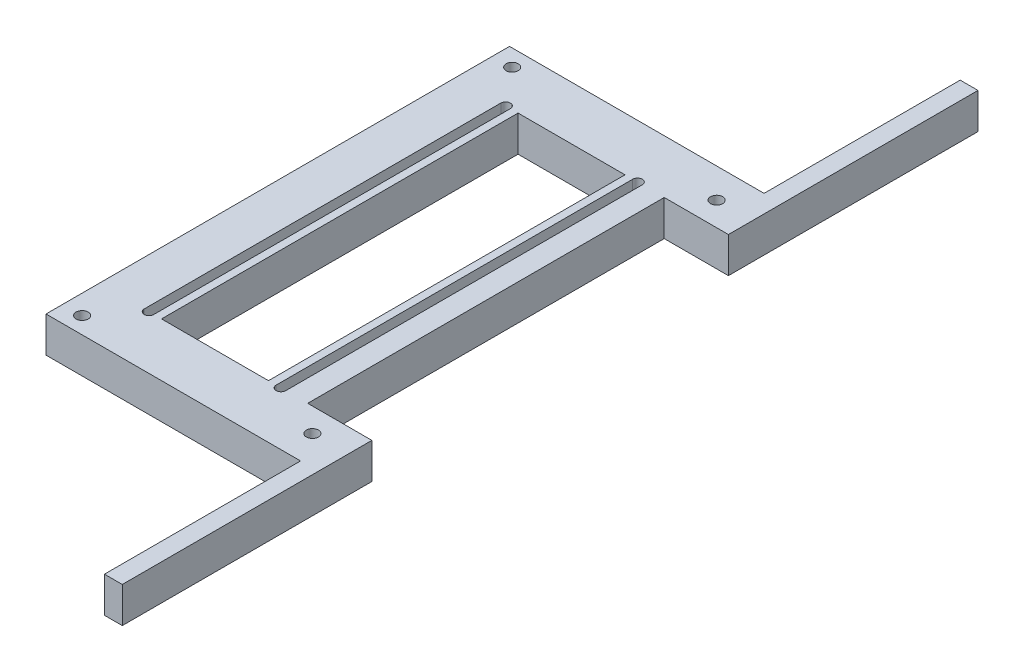
ISO-10303-21;
HEADER;
FILE_DESCRIPTION(('STEP AP214'),'2;1');
FILE_NAME('part.step','',(''),(''),'','','');
FILE_SCHEMA(('AUTOMOTIVE_DESIGN { 1 0 10303 214 1 1 1 1 }'));
ENDSEC;
DATA;
#1=APPLICATION_CONTEXT('core data for automotive mechanical design processes');
#2=APPLICATION_PROTOCOL_DEFINITION('international standard','automotive_design',2000,#1);
#3=PRODUCT_CONTEXT('',#1,'mechanical');
#4=PRODUCT('Part','Part','',(#3));
#5=PRODUCT_RELATED_PRODUCT_CATEGORY('part','',(#4));
#6=PRODUCT_DEFINITION_FORMATION('','',#4);
#7=PRODUCT_DEFINITION_CONTEXT('part definition',#1,'design');
#8=PRODUCT_DEFINITION('design','',#6,#7);
#9=PRODUCT_DEFINITION_SHAPE('','',#8);
#10=(LENGTH_UNIT() NAMED_UNIT(*) SI_UNIT(.MILLI.,.METRE.));
#11=(NAMED_UNIT(*) PLANE_ANGLE_UNIT() SI_UNIT($,.RADIAN.));
#12=(NAMED_UNIT(*) SI_UNIT($,.STERADIAN.) SOLID_ANGLE_UNIT());
#13=UNCERTAINTY_MEASURE_WITH_UNIT(LENGTH_MEASURE(1.E-05),#10,'distance_accuracy_value','');
#14=(GEOMETRIC_REPRESENTATION_CONTEXT(3) GLOBAL_UNCERTAINTY_ASSIGNED_CONTEXT((#13)) GLOBAL_UNIT_ASSIGNED_CONTEXT((#10,
#11,#12)) REPRESENTATION_CONTEXT('',''));
#15=CARTESIAN_POINT('',(0.,0.,0.));
#16=DIRECTION('',(0.,0.,1.));
#17=DIRECTION('',(1.,0.,0.));
#18=AXIS2_PLACEMENT_3D('',#15,#16,#17);
#19=CARTESIAN_POINT('',(5.3842412770572,10.,0.));
#20=DIRECTION('',(-1.,0.,0.));
#21=DIRECTION('',(0.,0.,1.));
#22=AXIS2_PLACEMENT_3D('',#19,#20,#21);
#23=PLANE('',#22);
#24=DIRECTION('',(0.,0.,-1.));
#25=VECTOR('',#24,1.);
#26=CARTESIAN_POINT('',(5.3842412770572,0.,0.));
#27=LINE('',#26,#25);
#28=CARTESIAN_POINT('',(5.38424127705721,0.,31.71875));
#29=VERTEX_POINT('',#28);
#30=CARTESIAN_POINT('',(5.38424127705717,0.,-68.28125));
#31=VERTEX_POINT('',#30);
#32=EDGE_CURVE('E303',#29,#31,#27,.T.);
#33=ORIENTED_EDGE('',*,*,#32,.T.);
#34=DIRECTION('',(0.,-1.,0.));
#35=VECTOR('',#34,1.);
#36=CARTESIAN_POINT('',(5.38424127705717,10.,-68.28125));
#37=LINE('',#36,#35);
#38=CARTESIAN_POINT('',(5.38424127705717,10.,-68.28125));
#39=VERTEX_POINT('',#38);
#40=EDGE_CURVE('E11',#39,#31,#37,.T.);
#41=ORIENTED_EDGE('',*,*,#40,.F.);
#42=DIRECTION('',(0.,0.,-1.));
#43=VECTOR('',#42,1.);
#44=CARTESIAN_POINT('',(5.3842412770572,10.,0.));
#45=LINE('',#44,#43);
#46=CARTESIAN_POINT('',(5.38424127705721,10.,31.71875));
#47=VERTEX_POINT('',#46);
#48=EDGE_CURVE('E214',#47,#39,#45,.T.);
#49=ORIENTED_EDGE('',*,*,#48,.F.);
#50=DIRECTION('',(0.,-1.,0.));
#51=VECTOR('',#50,1.);
#52=CARTESIAN_POINT('',(5.38424127705721,10.,31.71875));
#53=LINE('',#52,#51);
#54=EDGE_CURVE('E58',#47,#29,#53,.T.);
#55=ORIENTED_EDGE('',*,*,#54,.T.);
#56=EDGE_LOOP('',(#33,#41,#49,#55));
#57=FACE_BOUND('',#56,.T.);
#58=ADVANCED_FACE('F39',(#57),#23,.F.);
#59=CARTESIAN_POINT('',(6.73424127705717,10.,-68.28125));
#60=DIRECTION('',(0.,-1.,0.));
#61=DIRECTION('',(0.,0.,-1.));
#62=AXIS2_PLACEMENT_3D('',#59,#60,#61);
#63=CYLINDRICAL_SURFACE('',#62,1.35);
#64=CARTESIAN_POINT('',(6.73424127705717,0.,-68.28125));
#65=DIRECTION('',(0.,1.,0.));
#66=DIRECTION('',(0.,0.,1.));
#67=AXIS2_PLACEMENT_3D('',#64,#65,#66);
#68=CIRCLE('',#67,1.35);
#69=CARTESIAN_POINT('',(8.08424127705717,0.,-68.28125));
#70=VERTEX_POINT('',#69);
#71=EDGE_CURVE('E220',#31,#70,#68,.F.);
#72=ORIENTED_EDGE('',*,*,#71,.T.);
#73=DIRECTION('',(0.,-1.,0.));
#74=VECTOR('',#73,1.);
#75=CARTESIAN_POINT('',(8.08424127705717,10.,-68.28125));
#76=LINE('',#75,#74);
#77=CARTESIAN_POINT('',(8.08424127705717,10.,-68.28125));
#78=VERTEX_POINT('',#77);
#79=EDGE_CURVE('E49',#78,#70,#76,.T.);
#80=ORIENTED_EDGE('',*,*,#79,.F.);
#81=CARTESIAN_POINT('',(6.73424127705717,10.,-68.28125));
#82=DIRECTION('',(0.,1.,0.));
#83=DIRECTION('',(0.,0.,1.));
#84=AXIS2_PLACEMENT_3D('',#81,#82,#83);
#85=CIRCLE('',#84,1.35);
#86=EDGE_CURVE('E208',#39,#78,#85,.F.);
#87=ORIENTED_EDGE('',*,*,#86,.F.);
#88=ORIENTED_EDGE('',*,*,#40,.T.);
#89=EDGE_LOOP('',(#72,#80,#87,#88));
#90=FACE_BOUND('',#89,.T.);
#91=ADVANCED_FACE('F219',(#90),#63,.F.);
#92=CARTESIAN_POINT('',(8.08424127705721,10.,0.));
#93=DIRECTION('',(-1.,0.,0.));
#94=DIRECTION('',(0.,0.,1.));
#95=AXIS2_PLACEMENT_3D('',#92,#93,#94);
#96=PLANE('',#95);
#97=DIRECTION('',(0.,0.,-1.));
#98=VECTOR('',#97,1.);
#99=CARTESIAN_POINT('',(8.08424127705721,0.,0.));
#100=LINE('',#99,#98);
#101=CARTESIAN_POINT('',(8.08424127705721,0.,31.71875));
#102=VERTEX_POINT('',#101);
#103=EDGE_CURVE('E306',#102,#70,#100,.T.);
#104=ORIENTED_EDGE('',*,*,#103,.F.);
#105=DIRECTION('',(0.,-1.,0.));
#106=VECTOR('',#105,1.);
#107=CARTESIAN_POINT('',(8.08424127705721,10.,31.71875));
#108=LINE('',#107,#106);
#109=CARTESIAN_POINT('',(8.08424127705721,10.,31.71875));
#110=VERTEX_POINT('',#109);
#111=EDGE_CURVE('E132',#110,#102,#108,.T.);
#112=ORIENTED_EDGE('',*,*,#111,.F.);
#113=DIRECTION('',(0.,0.,-1.));
#114=VECTOR('',#113,1.);
#115=CARTESIAN_POINT('',(8.08424127705721,10.,0.));
#116=LINE('',#115,#114);
#117=EDGE_CURVE('E213',#110,#78,#116,.T.);
#118=ORIENTED_EDGE('',*,*,#117,.T.);
#119=ORIENTED_EDGE('',*,*,#79,.T.);
#120=EDGE_LOOP('',(#104,#112,#118,#119));
#121=FACE_BOUND('',#120,.T.);
#122=ADVANCED_FACE('F224',(#121),#96,.T.);
#123=CARTESIAN_POINT('',(-31.6157587229428,10.,0.));
#124=DIRECTION('',(-1.,0.,0.));
#125=DIRECTION('',(0.,0.,1.));
#126=AXIS2_PLACEMENT_3D('',#123,#124,#125);
#127=PLANE('',#126);
#128=DIRECTION('',(0.,0.,-1.));
#129=VECTOR('',#128,1.);
#130=CARTESIAN_POINT('',(-31.6157587229428,0.,0.));
#131=LINE('',#130,#129);
#132=CARTESIAN_POINT('',(-31.6157587229428,0.,31.71875));
#133=VERTEX_POINT('',#132);
#134=CARTESIAN_POINT('',(-31.6157587229428,0.,-68.28125));
#135=VERTEX_POINT('',#134);
#136=EDGE_CURVE('E291',#133,#135,#131,.T.);
#137=ORIENTED_EDGE('',*,*,#136,.T.);
#138=DIRECTION('',(0.,-1.,0.));
#139=VECTOR('',#138,1.);
#140=CARTESIAN_POINT('',(-31.6157587229428,10.,-68.28125));
#141=LINE('',#140,#139);
#142=CARTESIAN_POINT('',(-31.6157587229428,10.,-68.28125));
#143=VERTEX_POINT('',#142);
#144=EDGE_CURVE('E313',#143,#135,#141,.T.);
#145=ORIENTED_EDGE('',*,*,#144,.F.);
#146=DIRECTION('',(0.,0.,-1.));
#147=VECTOR('',#146,1.);
#148=CARTESIAN_POINT('',(-31.6157587229428,10.,0.));
#149=LINE('',#148,#147);
#150=CARTESIAN_POINT('',(-31.6157587229428,10.,31.71875));
#151=VERTEX_POINT('',#150);
#152=EDGE_CURVE('E792',#151,#143,#149,.T.);
#153=ORIENTED_EDGE('',*,*,#152,.F.);
#154=DIRECTION('',(0.,-1.,0.));
#155=VECTOR('',#154,1.);
#156=CARTESIAN_POINT('',(-31.6157587229428,10.,31.71875));
#157=LINE('',#156,#155);
#158=EDGE_CURVE('E315',#151,#133,#157,.T.);
#159=ORIENTED_EDGE('',*,*,#158,.T.);
#160=EDGE_LOOP('',(#137,#145,#153,#159));
#161=FACE_BOUND('',#160,.T.);
#162=ADVANCED_FACE('F447',(#161),#127,.F.);
#163=CARTESIAN_POINT('',(-30.2657587229428,10.,-68.28125));
#164=DIRECTION('',(0.,-1.,0.));
#165=DIRECTION('',(0.,0.,-1.));
#166=AXIS2_PLACEMENT_3D('',#163,#164,#165);
#167=CYLINDRICAL_SURFACE('',#166,1.35);
#168=CARTESIAN_POINT('',(-30.2657587229428,0.,-68.28125));
#169=DIRECTION('',(0.,1.,0.));
#170=DIRECTION('',(0.,0.,1.));
#171=AXIS2_PLACEMENT_3D('',#168,#169,#170);
#172=CIRCLE('',#171,1.35);
#173=CARTESIAN_POINT('',(-28.9157587229428,0.,-68.28125));
#174=VERTEX_POINT('',#173);
#175=EDGE_CURVE('E294',#135,#174,#172,.F.);
#176=ORIENTED_EDGE('',*,*,#175,.T.);
#177=DIRECTION('',(0.,-1.,0.));
#178=VECTOR('',#177,1.);
#179=CARTESIAN_POINT('',(-28.9157587229428,10.,-68.28125));
#180=LINE('',#179,#178);
#181=CARTESIAN_POINT('',(-28.9157587229428,10.,-68.28125));
#182=VERTEX_POINT('',#181);
#183=EDGE_CURVE('E320',#182,#174,#180,.T.);
#184=ORIENTED_EDGE('',*,*,#183,.F.);
#185=CARTESIAN_POINT('',(-30.2657587229428,10.,-68.28125));
#186=DIRECTION('',(0.,1.,0.));
#187=DIRECTION('',(0.,0.,1.));
#188=AXIS2_PLACEMENT_3D('',#185,#186,#187);
#189=CIRCLE('',#188,1.35);
#190=EDGE_CURVE('E795',#143,#182,#189,.F.);
#191=ORIENTED_EDGE('',*,*,#190,.F.);
#192=ORIENTED_EDGE('',*,*,#144,.T.);
#193=EDGE_LOOP('',(#176,#184,#191,#192));
#194=FACE_BOUND('',#193,.T.);
#195=ADVANCED_FACE('F443',(#194),#167,.F.);
#196=CARTESIAN_POINT('',(-28.9157587229428,10.,0.));
#197=DIRECTION('',(-1.,0.,0.));
#198=DIRECTION('',(0.,0.,1.));
#199=AXIS2_PLACEMENT_3D('',#196,#197,#198);
#200=PLANE('',#199);
#201=DIRECTION('',(0.,0.,-1.));
#202=VECTOR('',#201,1.);
#203=CARTESIAN_POINT('',(-28.9157587229428,0.,0.));
#204=LINE('',#203,#202);
#205=CARTESIAN_POINT('',(-28.9157587229428,0.,31.71875));
#206=VERTEX_POINT('',#205);
#207=EDGE_CURVE('E297',#206,#174,#204,.T.);
#208=ORIENTED_EDGE('',*,*,#207,.F.);
#209=DIRECTION('',(0.,-1.,0.));
#210=VECTOR('',#209,1.);
#211=CARTESIAN_POINT('',(-28.9157587229428,10.,31.71875));
#212=LINE('',#211,#210);
#213=CARTESIAN_POINT('',(-28.9157587229428,10.,31.71875));
#214=VERTEX_POINT('',#213);
#215=EDGE_CURVE('E317',#214,#206,#212,.T.);
#216=ORIENTED_EDGE('',*,*,#215,.F.);
#217=DIRECTION('',(0.,0.,-1.));
#218=VECTOR('',#217,1.);
#219=CARTESIAN_POINT('',(-28.9157587229428,10.,0.));
#220=LINE('',#219,#218);
#221=EDGE_CURVE('E802',#214,#182,#220,.T.);
#222=ORIENTED_EDGE('',*,*,#221,.T.);
#223=ORIENTED_EDGE('',*,*,#183,.T.);
#224=EDGE_LOOP('',(#208,#216,#222,#223));
#225=FACE_BOUND('',#224,.T.);
#226=ADVANCED_FACE('F439',(#225),#200,.T.);
#227=CARTESIAN_POINT('',(-26.7657587229428,10.,0.));
#228=DIRECTION('',(1.,0.,0.));
#229=DIRECTION('',(0.,0.,-1.));
#230=AXIS2_PLACEMENT_3D('',#227,#228,#229);
#231=PLANE('',#230);
#232=DIRECTION('',(0.,0.,1.));
#233=VECTOR('',#232,1.);
#234=CARTESIAN_POINT('',(-26.7657587229428,0.,0.));
#235=LINE('',#234,#233);
#236=CARTESIAN_POINT('',(-26.7657587229428,0.,-68.28125));
#237=VERTEX_POINT('',#236);
#238=CARTESIAN_POINT('',(-26.7657587229428,0.,31.71875));
#239=VERTEX_POINT('',#238);
#240=EDGE_CURVE('E276',#237,#239,#235,.T.);
#241=ORIENTED_EDGE('',*,*,#240,.F.);
#242=DIRECTION('',(0.,-1.,0.));
#243=VECTOR('',#242,1.);
#244=CARTESIAN_POINT('',(-26.7657587229428,10.,-68.28125));
#245=LINE('',#244,#243);
#246=CARTESIAN_POINT('',(-26.7657587229428,10.,-68.28125));
#247=VERTEX_POINT('',#246);
#248=EDGE_CURVE('E318',#247,#237,#245,.T.);
#249=ORIENTED_EDGE('',*,*,#248,.F.);
#250=DIRECTION('',(0.,0.,1.));
#251=VECTOR('',#250,1.);
#252=CARTESIAN_POINT('',(-26.7657587229428,10.,0.));
#253=LINE('',#252,#251);
#254=CARTESIAN_POINT('',(-26.7657587229428,10.,31.71875));
#255=VERTEX_POINT('',#254);
#256=EDGE_CURVE('E784',#247,#255,#253,.T.);
#257=ORIENTED_EDGE('',*,*,#256,.T.);
#258=DIRECTION('',(0.,-1.,0.));
#259=VECTOR('',#258,1.);
#260=CARTESIAN_POINT('',(-26.7657587229428,10.,31.71875));
#261=LINE('',#260,#259);
#262=EDGE_CURVE('E324',#255,#239,#261,.T.);
#263=ORIENTED_EDGE('',*,*,#262,.T.);
#264=EDGE_LOOP('',(#241,#249,#257,#263));
#265=FACE_BOUND('',#264,.T.);
#266=ADVANCED_FACE('F442',(#265),#231,.T.);
#267=CARTESIAN_POINT('',(0.,10.,-68.28125));
#268=DIRECTION('',(0.,0.,-1.));
#269=DIRECTION('',(-1.,0.,0.));
#270=AXIS2_PLACEMENT_3D('',#267,#268,#269);
#271=PLANE('',#270);
#272=DIRECTION('',(1.,0.,0.));
#273=VECTOR('',#272,1.);
#274=CARTESIAN_POINT('',(0.,0.,-68.28125));
#275=LINE('',#274,#273);
#276=CARTESIAN_POINT('',(3.23424127705717,0.,-68.28125));
#277=VERTEX_POINT('',#276);
#278=EDGE_CURVE('E279',#237,#277,#275,.T.);
#279=ORIENTED_EDGE('',*,*,#278,.T.);
#280=DIRECTION('',(0.,-1.,0.));
#281=VECTOR('',#280,1.);
#282=CARTESIAN_POINT('',(3.23424127705717,10.,-68.28125));
#283=LINE('',#282,#281);
#284=CARTESIAN_POINT('',(3.23424127705717,10.,-68.28125));
#285=VERTEX_POINT('',#284);
#286=EDGE_CURVE('E328',#285,#277,#283,.T.);
#287=ORIENTED_EDGE('',*,*,#286,.F.);
#288=DIRECTION('',(1.,0.,0.));
#289=VECTOR('',#288,1.);
#290=CARTESIAN_POINT('',(0.,10.,-68.28125));
#291=LINE('',#290,#289);
#292=EDGE_CURVE('E818',#247,#285,#291,.T.);
#293=ORIENTED_EDGE('',*,*,#292,.F.);
#294=ORIENTED_EDGE('',*,*,#248,.T.);
#295=EDGE_LOOP('',(#279,#287,#293,#294));
#296=FACE_BOUND('',#295,.T.);
#297=ADVANCED_FACE('F462',(#296),#271,.F.);
#298=CARTESIAN_POINT('',(3.2342412770572,10.,0.));
#299=DIRECTION('',(-1.,0.,0.));
#300=DIRECTION('',(0.,0.,1.));
#301=AXIS2_PLACEMENT_3D('',#298,#299,#300);
#302=PLANE('',#301);
#303=DIRECTION('',(0.,0.,-1.));
#304=VECTOR('',#303,1.);
#305=CARTESIAN_POINT('',(3.2342412770572,0.,0.));
#306=LINE('',#305,#304);
#307=CARTESIAN_POINT('',(3.23424127705721,0.,31.71875));
#308=VERTEX_POINT('',#307);
#309=EDGE_CURVE('E282',#308,#277,#306,.T.);
#310=ORIENTED_EDGE('',*,*,#309,.F.);
#311=DIRECTION('',(0.,-1.,0.));
#312=VECTOR('',#311,1.);
#313=CARTESIAN_POINT('',(3.23424127705721,10.,31.71875));
#314=LINE('',#313,#312);
#315=CARTESIAN_POINT('',(3.23424127705721,10.,31.71875));
#316=VERTEX_POINT('',#315);
#317=EDGE_CURVE('E326',#316,#308,#314,.T.);
#318=ORIENTED_EDGE('',*,*,#317,.F.);
#319=DIRECTION('',(0.,0.,-1.));
#320=VECTOR('',#319,1.);
#321=CARTESIAN_POINT('',(3.2342412770572,10.,0.));
#322=LINE('',#321,#320);
#323=EDGE_CURVE('E815',#316,#285,#322,.T.);
#324=ORIENTED_EDGE('',*,*,#323,.T.);
#325=ORIENTED_EDGE('',*,*,#286,.T.);
#326=EDGE_LOOP('',(#310,#318,#324,#325));
#327=FACE_BOUND('',#326,.T.);
#328=ADVANCED_FACE('F459',(#327),#302,.T.);
#329=CARTESIAN_POINT('',(32.2342412770573,10.,0.));
#330=DIRECTION('',(1.,0.,0.));
#331=DIRECTION('',(0.,0.,-1.));
#332=AXIS2_PLACEMENT_3D('',#329,#330,#331);
#333=PLANE('',#332);
#334=DIRECTION('',(0.,0.,1.));
#335=VECTOR('',#334,1.);
#336=CARTESIAN_POINT('',(32.2342412770573,0.,0.));
#337=LINE('',#336,#335);
#338=CARTESIAN_POINT('',(32.2342412770571,0.,-138.28125));
#339=VERTEX_POINT('',#338);
#340=CARTESIAN_POINT('',(32.2342412770572,0.,-68.28125));
#341=VERTEX_POINT('',#340);
#342=EDGE_CURVE('E240',#339,#341,#337,.T.);
#343=ORIENTED_EDGE('',*,*,#342,.F.);
#344=DIRECTION('',(0.,-1.,0.));
#345=VECTOR('',#344,1.);
#346=CARTESIAN_POINT('',(32.2342412770571,10.,-138.28125));
#347=LINE('',#346,#345);
#348=CARTESIAN_POINT('',(32.2342412770571,10.,-138.28125));
#349=VERTEX_POINT('',#348);
#350=EDGE_CURVE('E43',#349,#339,#347,.T.);
#351=ORIENTED_EDGE('',*,*,#350,.F.);
#352=DIRECTION('',(0.,0.,1.));
#353=VECTOR('',#352,1.);
#354=CARTESIAN_POINT('',(32.2342412770573,10.,0.));
#355=LINE('',#354,#353);
#356=CARTESIAN_POINT('',(32.2342412770572,10.,-68.28125));
#357=VERTEX_POINT('',#356);
#358=EDGE_CURVE('E367',#349,#357,#355,.T.);
#359=ORIENTED_EDGE('',*,*,#358,.T.);
#360=DIRECTION('',(0.,-1.,0.));
#361=VECTOR('',#360,1.);
#362=CARTESIAN_POINT('',(32.2342412770572,10.,-68.28125));
#363=LINE('',#362,#361);
#364=EDGE_CURVE('E227',#357,#341,#363,.T.);
#365=ORIENTED_EDGE('',*,*,#364,.T.);
#366=EDGE_LOOP('',(#343,#351,#359,#365));
#367=FACE_BOUND('',#366,.T.);
#368=ADVANCED_FACE('F366',(#367),#333,.T.);
#369=CARTESIAN_POINT('',(0.,10.,-138.28125));
#370=DIRECTION('',(0.,0.,1.));
#371=DIRECTION('',(1.,0.,0.));
#372=AXIS2_PLACEMENT_3D('',#369,#370,#371);
#373=PLANE('',#372);
#374=DIRECTION('',(-1.,0.,0.));
#375=VECTOR('',#374,1.);
#376=CARTESIAN_POINT('',(0.,0.,-138.28125));
#377=LINE('',#376,#375);
#378=CARTESIAN_POINT('',(27.2342412770571,0.,-138.28125));
#379=VERTEX_POINT('',#378);
#380=EDGE_CURVE('E243',#339,#379,#377,.T.);
#381=ORIENTED_EDGE('',*,*,#380,.T.);
#382=DIRECTION('',(0.,-1.,0.));
#383=VECTOR('',#382,1.);
#384=CARTESIAN_POINT('',(27.2342412770571,10.,-138.28125));
#385=LINE('',#384,#383);
#386=CARTESIAN_POINT('',(27.2342412770571,10.,-138.28125));
#387=VERTEX_POINT('',#386);
#388=EDGE_CURVE('E352',#387,#379,#385,.T.);
#389=ORIENTED_EDGE('',*,*,#388,.F.);
#390=DIRECTION('',(-1.,0.,0.));
#391=VECTOR('',#390,1.);
#392=CARTESIAN_POINT('',(0.,10.,-138.28125));
#393=LINE('',#392,#391);
#394=EDGE_CURVE('E360',#349,#387,#393,.T.);
#395=ORIENTED_EDGE('',*,*,#394,.F.);
#396=ORIENTED_EDGE('',*,*,#350,.T.);
#397=EDGE_LOOP('',(#381,#389,#395,#396));
#398=FACE_BOUND('',#397,.T.);
#399=ADVANCED_FACE('F358',(#398),#373,.F.);
#400=CARTESIAN_POINT('',(27.2342412770572,10.,0.));
#401=DIRECTION('',(1.,0.,0.));
#402=DIRECTION('',(0.,0.,-1.));
#403=AXIS2_PLACEMENT_3D('',#400,#401,#402);
#404=PLANE('',#403);
#405=DIRECTION('',(0.,0.,1.));
#406=VECTOR('',#405,1.);
#407=CARTESIAN_POINT('',(27.2342412770572,0.,0.));
#408=LINE('',#407,#406);
#409=CARTESIAN_POINT('',(27.2342412770572,0.,-83.28125));
#410=VERTEX_POINT('',#409);
#411=EDGE_CURVE('E246',#379,#410,#408,.T.);
#412=ORIENTED_EDGE('',*,*,#411,.T.);
#413=DIRECTION('',(0.,-1.,0.));
#414=VECTOR('',#413,1.);
#415=CARTESIAN_POINT('',(27.2342412770572,10.,-83.28125));
#416=LINE('',#415,#414);
#417=CARTESIAN_POINT('',(27.2342412770572,10.,-83.28125));
#418=VERTEX_POINT('',#417);
#419=EDGE_CURVE('E350',#418,#410,#416,.T.);
#420=ORIENTED_EDGE('',*,*,#419,.F.);
#421=DIRECTION('',(0.,0.,1.));
#422=VECTOR('',#421,1.);
#423=CARTESIAN_POINT('',(27.2342412770572,10.,0.));
#424=LINE('',#423,#422);
#425=EDGE_CURVE('E832',#387,#418,#424,.T.);
#426=ORIENTED_EDGE('',*,*,#425,.F.);
#427=ORIENTED_EDGE('',*,*,#388,.T.);
#428=EDGE_LOOP('',(#412,#420,#426,#427));
#429=FACE_BOUND('',#428,.T.);
#430=ADVANCED_FACE('F417',(#429),#404,.F.);
#431=CARTESIAN_POINT('',(0.,10.,-83.28125));
#432=DIRECTION('',(0.,0.,1.));
#433=DIRECTION('',(1.,0.,0.));
#434=AXIS2_PLACEMENT_3D('',#431,#432,#433);
#435=PLANE('',#434);
#436=DIRECTION('',(-1.,0.,0.));
#437=VECTOR('',#436,1.);
#438=CARTESIAN_POINT('',(0.,0.,-83.28125));
#439=LINE('',#438,#437);
#440=CARTESIAN_POINT('',(-44.1621448352043,0.,-83.28125));
#441=VERTEX_POINT('',#440);
#442=EDGE_CURVE('E249',#410,#441,#439,.T.);
#443=ORIENTED_EDGE('',*,*,#442,.T.);
#444=DIRECTION('',(0.,-1.,0.));
#445=VECTOR('',#444,1.);
#446=CARTESIAN_POINT('',(-44.1621448352043,10.,-83.28125));
#447=LINE('',#446,#445);
#448=CARTESIAN_POINT('',(-44.1621448352043,10.,-83.28125));
#449=VERTEX_POINT('',#448);
#450=EDGE_CURVE('E348',#449,#441,#447,.T.);
#451=ORIENTED_EDGE('',*,*,#450,.F.);
#452=DIRECTION('',(-1.,0.,0.));
#453=VECTOR('',#452,1.);
#454=CARTESIAN_POINT('',(0.,10.,-83.28125));
#455=LINE('',#454,#453);
#456=EDGE_CURVE('E415',#418,#449,#455,.T.);
#457=ORIENTED_EDGE('',*,*,#456,.F.);
#458=ORIENTED_EDGE('',*,*,#419,.T.);
#459=EDGE_LOOP('',(#443,#451,#457,#458));
#460=FACE_BOUND('',#459,.T.);
#461=ADVANCED_FACE('F413',(#460),#435,.F.);
#462=CARTESIAN_POINT('',(-44.1621448352043,10.,0.));
#463=DIRECTION('',(-1.,0.,0.));
#464=DIRECTION('',(0.,0.,1.));
#465=AXIS2_PLACEMENT_3D('',#462,#463,#464);
#466=PLANE('',#465);
#467=DIRECTION('',(0.,0.,-1.));
#468=VECTOR('',#467,1.);
#469=CARTESIAN_POINT('',(-44.1621448352043,0.,0.));
#470=LINE('',#469,#468);
#471=CARTESIAN_POINT('',(-44.1621448352043,0.,46.71875));
#472=VERTEX_POINT('',#471);
#473=EDGE_CURVE('E252',#472,#441,#470,.T.);
#474=ORIENTED_EDGE('',*,*,#473,.F.);
#475=DIRECTION('',(0.,-1.,0.));
#476=VECTOR('',#475,1.);
#477=CARTESIAN_POINT('',(-44.1621448352043,10.,46.71875));
#478=LINE('',#477,#476);
#479=CARTESIAN_POINT('',(-44.1621448352043,10.,46.71875));
#480=VERTEX_POINT('',#479);
#481=EDGE_CURVE('E346',#480,#472,#478,.T.);
#482=ORIENTED_EDGE('',*,*,#481,.F.);
#483=DIRECTION('',(0.,0.,-1.));
#484=VECTOR('',#483,1.);
#485=CARTESIAN_POINT('',(-44.1621448352043,10.,0.));
#486=LINE('',#485,#484);
#487=EDGE_CURVE('E411',#480,#449,#486,.T.);
#488=ORIENTED_EDGE('',*,*,#487,.T.);
#489=ORIENTED_EDGE('',*,*,#450,.T.);
#490=EDGE_LOOP('',(#474,#482,#488,#489));
#491=FACE_BOUND('',#490,.T.);
#492=ADVANCED_FACE('F409',(#491),#466,.T.);
#493=CARTESIAN_POINT('',(0.,10.,46.71875));
#494=DIRECTION('',(0.,0.,1.));
#495=DIRECTION('',(1.,0.,0.));
#496=AXIS2_PLACEMENT_3D('',#493,#494,#495);
#497=PLANE('',#496);
#498=DIRECTION('',(-1.,0.,0.));
#499=VECTOR('',#498,1.);
#500=CARTESIAN_POINT('',(0.,0.,46.71875));
#501=LINE('',#500,#499);
#502=CARTESIAN_POINT('',(27.2342412770572,0.,46.71875));
#503=VERTEX_POINT('',#502);
#504=EDGE_CURVE('E255',#503,#472,#501,.T.);
#505=ORIENTED_EDGE('',*,*,#504,.F.);
#506=DIRECTION('',(0.,-1.,0.));
#507=VECTOR('',#506,1.);
#508=CARTESIAN_POINT('',(27.2342412770572,10.,46.71875));
#509=LINE('',#508,#507);
#510=CARTESIAN_POINT('',(27.2342412770572,10.,46.71875));
#511=VERTEX_POINT('',#510);
#512=EDGE_CURVE('E344',#511,#503,#509,.T.);
#513=ORIENTED_EDGE('',*,*,#512,.F.);
#514=DIRECTION('',(-1.,0.,0.));
#515=VECTOR('',#514,1.);
#516=CARTESIAN_POINT('',(0.,10.,46.71875));
#517=LINE('',#516,#515);
#518=EDGE_CURVE('E405',#511,#480,#517,.T.);
#519=ORIENTED_EDGE('',*,*,#518,.T.);
#520=ORIENTED_EDGE('',*,*,#481,.T.);
#521=EDGE_LOOP('',(#505,#513,#519,#520));
#522=FACE_BOUND('',#521,.T.);
#523=ADVANCED_FACE('F402',(#522),#497,.T.);
#524=CARTESIAN_POINT('',(27.2342412770572,10.,0.));
#525=DIRECTION('',(-1.,0.,0.));
#526=DIRECTION('',(0.,0.,1.));
#527=AXIS2_PLACEMENT_3D('',#524,#525,#526);
#528=PLANE('',#527);
#529=DIRECTION('',(0.,0.,-1.));
#530=VECTOR('',#529,1.);
#531=CARTESIAN_POINT('',(27.2342412770572,0.,0.));
#532=LINE('',#531,#530);
#533=CARTESIAN_POINT('',(27.2342412770572,0.,101.71875));
#534=VERTEX_POINT('',#533);
#535=EDGE_CURVE('E258',#534,#503,#532,.T.);
#536=ORIENTED_EDGE('',*,*,#535,.F.);
#537=DIRECTION('',(0.,-1.,0.));
#538=VECTOR('',#537,1.);
#539=CARTESIAN_POINT('',(27.2342412770572,10.,101.71875));
#540=LINE('',#539,#538);
#541=CARTESIAN_POINT('',(27.2342412770572,10.,101.71875));
#542=VERTEX_POINT('',#541);
#543=EDGE_CURVE('E342',#542,#534,#540,.T.);
#544=ORIENTED_EDGE('',*,*,#543,.F.);
#545=DIRECTION('',(0.,0.,-1.));
#546=VECTOR('',#545,1.);
#547=CARTESIAN_POINT('',(27.2342412770572,10.,0.));
#548=LINE('',#547,#546);
#549=EDGE_CURVE('E827',#542,#511,#548,.T.);
#550=ORIENTED_EDGE('',*,*,#549,.T.);
#551=ORIENTED_EDGE('',*,*,#512,.T.);
#552=EDGE_LOOP('',(#536,#544,#550,#551));
#553=FACE_BOUND('',#552,.T.);
#554=ADVANCED_FACE('F398',(#553),#528,.T.);
#555=CARTESIAN_POINT('',(0.,10.,101.71875));
#556=DIRECTION('',(0.,0.,1.));
#557=DIRECTION('',(1.,0.,0.));
#558=AXIS2_PLACEMENT_3D('',#555,#556,#557);
#559=PLANE('',#558);
#560=DIRECTION('',(-1.,0.,0.));
#561=VECTOR('',#560,1.);
#562=CARTESIAN_POINT('',(0.,0.,101.71875));
#563=LINE('',#562,#561);
#564=CARTESIAN_POINT('',(32.2342412770572,0.,101.71875));
#565=VERTEX_POINT('',#564);
#566=EDGE_CURVE('E261',#565,#534,#563,.T.);
#567=ORIENTED_EDGE('',*,*,#566,.F.);
#568=DIRECTION('',(0.,-1.,0.));
#569=VECTOR('',#568,1.);
#570=CARTESIAN_POINT('',(32.2342412770572,10.,101.71875));
#571=LINE('',#570,#569);
#572=CARTESIAN_POINT('',(32.2342412770572,10.,101.71875));
#573=VERTEX_POINT('',#572);
#574=EDGE_CURVE('E340',#573,#565,#571,.T.);
#575=ORIENTED_EDGE('',*,*,#574,.F.);
#576=DIRECTION('',(-1.,0.,0.));
#577=VECTOR('',#576,1.);
#578=CARTESIAN_POINT('',(0.,10.,101.71875));
#579=LINE('',#578,#577);
#580=EDGE_CURVE('E394',#573,#542,#579,.T.);
#581=ORIENTED_EDGE('',*,*,#580,.T.);
#582=ORIENTED_EDGE('',*,*,#543,.T.);
#583=EDGE_LOOP('',(#567,#575,#581,#582));
#584=FACE_BOUND('',#583,.T.);
#585=ADVANCED_FACE('F390',(#584),#559,.T.);
#586=CARTESIAN_POINT('',(32.2342412770572,10.,0.));
#587=DIRECTION('',(-1.,0.,0.));
#588=DIRECTION('',(0.,0.,1.));
#589=AXIS2_PLACEMENT_3D('',#586,#587,#588);
#590=PLANE('',#589);
#591=DIRECTION('',(0.,0.,-1.));
#592=VECTOR('',#591,1.);
#593=CARTESIAN_POINT('',(32.2342412770572,0.,0.));
#594=LINE('',#593,#592);
#595=CARTESIAN_POINT('',(32.2342412770572,0.,31.71875));
#596=VERTEX_POINT('',#595);
#597=EDGE_CURVE('E264',#565,#596,#594,.T.);
#598=ORIENTED_EDGE('',*,*,#597,.T.);
#599=DIRECTION('',(0.,-1.,0.));
#600=VECTOR('',#599,1.);
#601=CARTESIAN_POINT('',(32.2342412770572,10.,31.71875));
#602=LINE('',#601,#600);
#603=CARTESIAN_POINT('',(32.2342412770572,10.,31.71875));
#604=VERTEX_POINT('',#603);
#605=EDGE_CURVE('E337',#604,#596,#602,.T.);
#606=ORIENTED_EDGE('',*,*,#605,.F.);
#607=DIRECTION('',(0.,0.,-1.));
#608=VECTOR('',#607,1.);
#609=CARTESIAN_POINT('',(32.2342412770572,10.,0.));
#610=LINE('',#609,#608);
#611=EDGE_CURVE('E824',#573,#604,#610,.T.);
#612=ORIENTED_EDGE('',*,*,#611,.F.);
#613=ORIENTED_EDGE('',*,*,#574,.T.);
#614=EDGE_LOOP('',(#598,#606,#612,#613));
#615=FACE_BOUND('',#614,.T.);
#616=ADVANCED_FACE('F387',(#615),#590,.F.);
#617=CARTESIAN_POINT('',(0.,10.,31.71875));
#618=DIRECTION('',(0.,0.,1.));
#619=DIRECTION('',(1.,0.,0.));
#620=AXIS2_PLACEMENT_3D('',#617,#618,#619);
#621=PLANE('',#620);
#622=DIRECTION('',(-1.,0.,0.));
#623=VECTOR('',#622,1.);
#624=CARTESIAN_POINT('',(0.,0.,31.71875));
#625=LINE('',#624,#623);
#626=CARTESIAN_POINT('',(14.2342412770572,0.,31.71875));
#627=VERTEX_POINT('',#626);
#628=EDGE_CURVE('E267',#596,#627,#625,.T.);
#629=ORIENTED_EDGE('',*,*,#628,.T.);
#630=DIRECTION('',(0.,-1.,0.));
#631=VECTOR('',#630,1.);
#632=CARTESIAN_POINT('',(14.2342412770572,10.,31.71875));
#633=LINE('',#632,#631);
#634=CARTESIAN_POINT('',(14.2342412770572,10.,31.71875));
#635=VERTEX_POINT('',#634);
#636=EDGE_CURVE('E334',#635,#627,#633,.T.);
#637=ORIENTED_EDGE('',*,*,#636,.F.);
#638=DIRECTION('',(-1.,0.,0.));
#639=VECTOR('',#638,1.);
#640=CARTESIAN_POINT('',(0.,10.,31.71875));
#641=LINE('',#640,#639);
#642=EDGE_CURVE('E383',#604,#635,#641,.T.);
#643=ORIENTED_EDGE('',*,*,#642,.F.);
#644=ORIENTED_EDGE('',*,*,#605,.T.);
#645=EDGE_LOOP('',(#629,#637,#643,#644));
#646=FACE_BOUND('',#645,.T.);
#647=ADVANCED_FACE('F381',(#646),#621,.F.);
#648=CARTESIAN_POINT('',(14.2342412770572,10.,0.));
#649=DIRECTION('',(-1.,0.,0.));
#650=DIRECTION('',(0.,0.,1.));
#651=AXIS2_PLACEMENT_3D('',#648,#649,#650);
#652=PLANE('',#651);
#653=DIRECTION('',(0.,0.,-1.));
#654=VECTOR('',#653,1.);
#655=CARTESIAN_POINT('',(14.2342412770572,0.,0.));
#656=LINE('',#655,#654);
#657=CARTESIAN_POINT('',(14.2342412770572,0.,-68.28125));
#658=VERTEX_POINT('',#657);
#659=EDGE_CURVE('E270',#627,#658,#656,.T.);
#660=ORIENTED_EDGE('',*,*,#659,.T.);
#661=DIRECTION('',(0.,-1.,0.));
#662=VECTOR('',#661,1.);
#663=CARTESIAN_POINT('',(14.2342412770572,10.,-68.28125));
#664=LINE('',#663,#662);
#665=CARTESIAN_POINT('',(14.2342412770572,10.,-68.28125));
#666=VERTEX_POINT('',#665);
#667=EDGE_CURVE('E332',#666,#658,#664,.T.);
#668=ORIENTED_EDGE('',*,*,#667,.F.);
#669=DIRECTION('',(0.,0.,-1.));
#670=VECTOR('',#669,1.);
#671=CARTESIAN_POINT('',(14.2342412770572,10.,0.));
#672=LINE('',#671,#670);
#673=EDGE_CURVE('E378',#635,#666,#672,.T.);
#674=ORIENTED_EDGE('',*,*,#673,.F.);
#675=ORIENTED_EDGE('',*,*,#636,.T.);
#676=EDGE_LOOP('',(#660,#668,#674,#675));
#677=FACE_BOUND('',#676,.T.);
#678=ADVANCED_FACE('F377',(#677),#652,.F.);
#679=CARTESIAN_POINT('',(-30.2657587229428,10.,31.71875));
#680=DIRECTION('',(0.,-1.,0.));
#681=DIRECTION('',(0.,0.,-1.));
#682=AXIS2_PLACEMENT_3D('',#679,#680,#681);
#683=CYLINDRICAL_SURFACE('',#682,1.35);
#684=CARTESIAN_POINT('',(-30.2657587229428,0.,31.71875));
#685=DIRECTION('',(0.,1.,0.));
#686=DIRECTION('',(0.,0.,1.));
#687=AXIS2_PLACEMENT_3D('',#684,#685,#686);
#688=CIRCLE('',#687,1.35);
#689=EDGE_CURVE('E300',#133,#206,#688,.T.);
#690=ORIENTED_EDGE('',*,*,#689,.F.);
#691=ORIENTED_EDGE('',*,*,#158,.F.);
#692=CARTESIAN_POINT('',(-30.2657587229428,10.,31.71875));
#693=DIRECTION('',(0.,1.,0.));
#694=DIRECTION('',(0.,0.,1.));
#695=AXIS2_PLACEMENT_3D('',#692,#693,#694);
#696=CIRCLE('',#695,1.35);
#697=EDGE_CURVE('E798',#151,#214,#696,.T.);
#698=ORIENTED_EDGE('',*,*,#697,.T.);
#699=ORIENTED_EDGE('',*,*,#215,.T.);
#700=EDGE_LOOP('',(#690,#691,#698,#699));
#701=FACE_BOUND('',#700,.T.);
#702=ADVANCED_FACE('F434',(#701),#683,.F.);
#703=CARTESIAN_POINT('',(-38.7190510776372,10.,-78.5879530223041));
#704=DIRECTION('',(0.,-1.,0.));
#705=DIRECTION('',(0.,0.,-1.));
#706=AXIS2_PLACEMENT_3D('',#703,#704,#705);
#707=CYLINDRICAL_SURFACE('',#706,1.7);
#708=CARTESIAN_POINT('',(-38.7190510776372,10.,-78.5879530223041));
#709=DIRECTION('',(0.,1.,0.));
#710=DIRECTION('',(0.,0.,1.));
#711=AXIS2_PLACEMENT_3D('',#708,#709,#710);
#712=CIRCLE('',#711,1.7);
#713=CARTESIAN_POINT('',(-38.7190510776372,10.,-76.8879530223041));
#714=VERTEX_POINT('',#713);
#715=EDGE_CURVE('E788',#714,#714,#712,.F.);
#716=ORIENTED_EDGE('',*,*,#715,.F.);
#717=EDGE_LOOP('',(#716));
#718=FACE_BOUND('',#717,.T.);
#719=CARTESIAN_POINT('',(-38.7190510776372,0.,-78.5879530223041));
#720=DIRECTION('',(0.,1.,0.));
#721=DIRECTION('',(0.,0.,1.));
#722=AXIS2_PLACEMENT_3D('',#719,#720,#721);
#723=CIRCLE('',#722,1.7);
#724=CARTESIAN_POINT('',(-38.7190510776372,0.,-76.8879530223041));
#725=VERTEX_POINT('',#724);
#726=EDGE_CURVE('E288',#725,#725,#723,.F.);
#727=ORIENTED_EDGE('',*,*,#726,.T.);
#728=EDGE_LOOP('',(#727));
#729=FACE_BOUND('',#728,.T.);
#730=ADVANCED_FACE('F437',(#718,#729),#707,.F.);
#731=CARTESIAN_POINT('',(0.,10.,31.71875));
#732=DIRECTION('',(0.,0.,-1.));
#733=DIRECTION('',(-1.,0.,0.));
#734=AXIS2_PLACEMENT_3D('',#731,#732,#733);
#735=PLANE('',#734);
#736=DIRECTION('',(1.,0.,0.));
#737=VECTOR('',#736,1.);
#738=CARTESIAN_POINT('',(0.,0.,31.71875));
#739=LINE('',#738,#737);
#740=EDGE_CURVE('E285',#239,#308,#739,.T.);
#741=ORIENTED_EDGE('',*,*,#740,.F.);
#742=ORIENTED_EDGE('',*,*,#262,.F.);
#743=DIRECTION('',(1.,0.,0.));
#744=VECTOR('',#743,1.);
#745=CARTESIAN_POINT('',(0.,10.,31.71875));
#746=LINE('',#745,#744);
#747=EDGE_CURVE('E812',#255,#316,#746,.T.);
#748=ORIENTED_EDGE('',*,*,#747,.T.);
#749=ORIENTED_EDGE('',*,*,#317,.T.);
#750=EDGE_LOOP('',(#741,#742,#748,#749));
#751=FACE_BOUND('',#750,.T.);
#752=ADVANCED_FACE('F454',(#751),#735,.T.);
#753=CARTESIAN_POINT('',(0.,10.,-68.28125));
#754=DIRECTION('',(0.,0.,1.));
#755=DIRECTION('',(1.,0.,0.));
#756=AXIS2_PLACEMENT_3D('',#753,#754,#755);
#757=PLANE('',#756);
#758=DIRECTION('',(-1.,0.,0.));
#759=VECTOR('',#758,1.);
#760=CARTESIAN_POINT('',(0.,0.,-68.28125));
#761=LINE('',#760,#759);
#762=EDGE_CURVE('E273',#341,#658,#761,.T.);
#763=ORIENTED_EDGE('',*,*,#762,.F.);
#764=ORIENTED_EDGE('',*,*,#364,.F.);
#765=DIRECTION('',(-1.,0.,0.));
#766=VECTOR('',#765,1.);
#767=CARTESIAN_POINT('',(0.,10.,-68.28125));
#768=LINE('',#767,#766);
#769=EDGE_CURVE('E372',#357,#666,#768,.T.);
#770=ORIENTED_EDGE('',*,*,#769,.T.);
#771=ORIENTED_EDGE('',*,*,#667,.T.);
#772=EDGE_LOOP('',(#763,#764,#770,#771));
#773=FACE_BOUND('',#772,.T.);
#774=ADVANCED_FACE('F371',(#773),#757,.T.);
#775=CARTESIAN_POINT('',(-38.7190510776372,10.,42.0254530223041));
#776=DIRECTION('',(0.,-1.,0.));
#777=DIRECTION('',(0.,0.,-1.));
#778=AXIS2_PLACEMENT_3D('',#775,#776,#777);
#779=CYLINDRICAL_SURFACE('',#778,1.7);
#780=CARTESIAN_POINT('',(-38.7190510776372,10.,42.0254530223041));
#781=DIRECTION('',(0.,1.,0.));
#782=DIRECTION('',(0.,0.,1.));
#783=AXIS2_PLACEMENT_3D('',#780,#781,#782);
#784=CIRCLE('',#783,1.7);
#785=CARTESIAN_POINT('',(-38.7190510776372,10.,43.7254530223041));
#786=VERTEX_POINT('',#785);
#787=EDGE_CURVE('E778',#786,#786,#784,.T.);
#788=ORIENTED_EDGE('',*,*,#787,.T.);
#789=EDGE_LOOP('',(#788));
#790=FACE_BOUND('',#789,.T.);
#791=CARTESIAN_POINT('',(-38.7190510776372,0.,42.0254530223041));
#792=DIRECTION('',(0.,1.,0.));
#793=DIRECTION('',(0.,0.,1.));
#794=AXIS2_PLACEMENT_3D('',#791,#792,#793);
#795=CIRCLE('',#794,1.7);
#796=CARTESIAN_POINT('',(-38.7190510776372,0.,43.7254530223041));
#797=VERTEX_POINT('',#796);
#798=EDGE_CURVE('E237',#797,#797,#795,.T.);
#799=ORIENTED_EDGE('',*,*,#798,.F.);
#800=EDGE_LOOP('',(#799));
#801=FACE_BOUND('',#800,.T.);
#802=ADVANCED_FACE('F472',(#790,#801),#779,.F.);
#803=CARTESIAN_POINT('',(22.2342412770572,10.,38.4007658668375));
#804=DIRECTION('',(0.,-1.,0.));
#805=DIRECTION('',(0.,0.,-1.));
#806=AXIS2_PLACEMENT_3D('',#803,#804,#805);
#807=CYLINDRICAL_SURFACE('',#806,1.7);
#808=CARTESIAN_POINT('',(22.2342412770572,10.,38.4007658668375));
#809=DIRECTION('',(0.,1.,0.));
#810=DIRECTION('',(0.,0.,1.));
#811=AXIS2_PLACEMENT_3D('',#808,#809,#810);
#812=CIRCLE('',#811,1.7);
#813=CARTESIAN_POINT('',(22.2342412770572,10.,40.1007658668375));
#814=VERTEX_POINT('',#813);
#815=EDGE_CURVE('E774',#814,#814,#812,.T.);
#816=ORIENTED_EDGE('',*,*,#815,.T.);
#817=EDGE_LOOP('',(#816));
#818=FACE_BOUND('',#817,.T.);
#819=CARTESIAN_POINT('',(22.2342412770572,0.,38.4007658668375));
#820=DIRECTION('',(0.,1.,0.));
#821=DIRECTION('',(0.,0.,1.));
#822=AXIS2_PLACEMENT_3D('',#819,#820,#821);
#823=CIRCLE('',#822,1.7);
#824=CARTESIAN_POINT('',(22.2342412770572,0.,40.1007658668375));
#825=VERTEX_POINT('',#824);
#826=EDGE_CURVE('E234',#825,#825,#823,.T.);
#827=ORIENTED_EDGE('',*,*,#826,.F.);
#828=EDGE_LOOP('',(#827));
#829=FACE_BOUND('',#828,.T.);
#830=ADVANCED_FACE('F536',(#818,#829),#807,.F.);
#831=CARTESIAN_POINT('',(22.2342412770572,10.,-74.9632658668375));
#832=DIRECTION('',(0.,-1.,0.));
#833=DIRECTION('',(0.,0.,-1.));
#834=AXIS2_PLACEMENT_3D('',#831,#832,#833);
#835=CYLINDRICAL_SURFACE('',#834,1.7);
#836=CARTESIAN_POINT('',(22.2342412770572,10.,-74.9632658668375));
#837=DIRECTION('',(0.,1.,0.));
#838=DIRECTION('',(0.,0.,1.));
#839=AXIS2_PLACEMENT_3D('',#836,#837,#838);
#840=CIRCLE('',#839,1.7);
#841=CARTESIAN_POINT('',(22.2342412770572,10.,-73.2632658668375));
#842=VERTEX_POINT('',#841);
#843=EDGE_CURVE('E311',#842,#842,#840,.F.);
#844=ORIENTED_EDGE('',*,*,#843,.F.);
#845=EDGE_LOOP('',(#844));
#846=FACE_BOUND('',#845,.T.);
#847=CARTESIAN_POINT('',(22.2342412770572,0.,-74.9632658668375));
#848=DIRECTION('',(0.,1.,0.));
#849=DIRECTION('',(0.,0.,1.));
#850=AXIS2_PLACEMENT_3D('',#847,#848,#849);
#851=CIRCLE('',#850,1.7);
#852=CARTESIAN_POINT('',(22.2342412770572,0.,-73.2632658668375));
#853=VERTEX_POINT('',#852);
#854=EDGE_CURVE('E231',#853,#853,#851,.F.);
#855=ORIENTED_EDGE('',*,*,#854,.T.);
#856=EDGE_LOOP('',(#855));
#857=FACE_BOUND('',#856,.T.);
#858=ADVANCED_FACE('F41',(#846,#857),#835,.F.);
#859=CARTESIAN_POINT('',(6.73424127705721,10.,31.71875));
#860=DIRECTION('',(0.,-1.,0.));
#861=DIRECTION('',(0.,0.,-1.));
#862=AXIS2_PLACEMENT_3D('',#859,#860,#861);
#863=CYLINDRICAL_SURFACE('',#862,1.35);
#864=CARTESIAN_POINT('',(6.73424127705721,0.,31.71875));
#865=DIRECTION('',(0.,1.,0.));
#866=DIRECTION('',(0.,0.,1.));
#867=AXIS2_PLACEMENT_3D('',#864,#865,#866);
#868=CIRCLE('',#867,1.35);
#869=EDGE_CURVE('E308',#29,#102,#868,.T.);
#870=ORIENTED_EDGE('',*,*,#869,.F.);
#871=ORIENTED_EDGE('',*,*,#54,.F.);
#872=CARTESIAN_POINT('',(6.73424127705721,10.,31.71875));
#873=DIRECTION('',(0.,1.,0.));
#874=DIRECTION('',(0.,0.,1.));
#875=AXIS2_PLACEMENT_3D('',#872,#873,#874);
#876=CIRCLE('',#875,1.35);
#877=EDGE_CURVE('E225',#47,#110,#876,.T.);
#878=ORIENTED_EDGE('',*,*,#877,.T.);
#879=ORIENTED_EDGE('',*,*,#111,.T.);
#880=EDGE_LOOP('',(#870,#871,#878,#879));
#881=FACE_BOUND('',#880,.T.);
#882=ADVANCED_FACE('F550',(#881),#863,.F.);
#883=CARTESIAN_POINT('',(0.,10.,0.));
#884=DIRECTION('',(0.,1.,0.));
#885=DIRECTION('',(0.,0.,1.));
#886=AXIS2_PLACEMENT_3D('',#883,#884,#885);
#887=PLANE('',#886);
#888=ORIENTED_EDGE('',*,*,#843,.T.);
#889=EDGE_LOOP('',(#888));
#890=FACE_BOUND('',#889,.T.);
#891=ORIENTED_EDGE('',*,*,#815,.F.);
#892=EDGE_LOOP('',(#891));
#893=FACE_BOUND('',#892,.T.);
#894=ORIENTED_EDGE('',*,*,#787,.F.);
#895=EDGE_LOOP('',(#894));
#896=FACE_BOUND('',#895,.T.);
#897=ORIENTED_EDGE('',*,*,#358,.F.);
#898=ORIENTED_EDGE('',*,*,#394,.T.);
#899=ORIENTED_EDGE('',*,*,#425,.T.);
#900=ORIENTED_EDGE('',*,*,#456,.T.);
#901=ORIENTED_EDGE('',*,*,#487,.F.);
#902=ORIENTED_EDGE('',*,*,#518,.F.);
#903=ORIENTED_EDGE('',*,*,#549,.F.);
#904=ORIENTED_EDGE('',*,*,#580,.F.);
#905=ORIENTED_EDGE('',*,*,#611,.T.);
#906=ORIENTED_EDGE('',*,*,#642,.T.);
#907=ORIENTED_EDGE('',*,*,#673,.T.);
#908=ORIENTED_EDGE('',*,*,#769,.F.);
#909=EDGE_LOOP('',(#897,#898,#899,#900,#901,#902,#903,#904,#905,#906,#907,#908));
#910=FACE_BOUND('',#909,.T.);
#911=ORIENTED_EDGE('',*,*,#256,.F.);
#912=ORIENTED_EDGE('',*,*,#292,.T.);
#913=ORIENTED_EDGE('',*,*,#323,.F.);
#914=ORIENTED_EDGE('',*,*,#747,.F.);
#915=EDGE_LOOP('',(#911,#912,#913,#914));
#916=FACE_BOUND('',#915,.T.);
#917=ORIENTED_EDGE('',*,*,#715,.T.);
#918=EDGE_LOOP('',(#917));
#919=FACE_BOUND('',#918,.T.);
#920=ORIENTED_EDGE('',*,*,#152,.T.);
#921=ORIENTED_EDGE('',*,*,#190,.T.);
#922=ORIENTED_EDGE('',*,*,#221,.F.);
#923=ORIENTED_EDGE('',*,*,#697,.F.);
#924=EDGE_LOOP('',(#920,#921,#922,#923));
#925=FACE_BOUND('',#924,.T.);
#926=ORIENTED_EDGE('',*,*,#48,.T.);
#927=ORIENTED_EDGE('',*,*,#86,.T.);
#928=ORIENTED_EDGE('',*,*,#117,.F.);
#929=ORIENTED_EDGE('',*,*,#877,.F.);
#930=EDGE_LOOP('',(#926,#927,#928,#929));
#931=FACE_BOUND('',#930,.T.);
#932=ADVANCED_FACE('F210',(#890,#893,#896,#910,#916,#919,#925,#931),#887,.T.);
#933=CARTESIAN_POINT('',(0.,0.,0.));
#934=DIRECTION('',(0.,1.,0.));
#935=DIRECTION('',(0.,0.,1.));
#936=AXIS2_PLACEMENT_3D('',#933,#934,#935);
#937=PLANE('',#936);
#938=ORIENTED_EDGE('',*,*,#854,.F.);
#939=EDGE_LOOP('',(#938));
#940=FACE_BOUND('',#939,.T.);
#941=ORIENTED_EDGE('',*,*,#826,.T.);
#942=EDGE_LOOP('',(#941));
#943=FACE_BOUND('',#942,.T.);
#944=ORIENTED_EDGE('',*,*,#798,.T.);
#945=EDGE_LOOP('',(#944));
#946=FACE_BOUND('',#945,.T.);
#947=ORIENTED_EDGE('',*,*,#342,.T.);
#948=ORIENTED_EDGE('',*,*,#762,.T.);
#949=ORIENTED_EDGE('',*,*,#659,.F.);
#950=ORIENTED_EDGE('',*,*,#628,.F.);
#951=ORIENTED_EDGE('',*,*,#597,.F.);
#952=ORIENTED_EDGE('',*,*,#566,.T.);
#953=ORIENTED_EDGE('',*,*,#535,.T.);
#954=ORIENTED_EDGE('',*,*,#504,.T.);
#955=ORIENTED_EDGE('',*,*,#473,.T.);
#956=ORIENTED_EDGE('',*,*,#442,.F.);
#957=ORIENTED_EDGE('',*,*,#411,.F.);
#958=ORIENTED_EDGE('',*,*,#380,.F.);
#959=EDGE_LOOP('',(#947,#948,#949,#950,#951,#952,#953,#954,#955,#956,#957,#958));
#960=FACE_BOUND('',#959,.T.);
#961=ORIENTED_EDGE('',*,*,#240,.T.);
#962=ORIENTED_EDGE('',*,*,#740,.T.);
#963=ORIENTED_EDGE('',*,*,#309,.T.);
#964=ORIENTED_EDGE('',*,*,#278,.F.);
#965=EDGE_LOOP('',(#961,#962,#963,#964));
#966=FACE_BOUND('',#965,.T.);
#967=ORIENTED_EDGE('',*,*,#726,.F.);
#968=EDGE_LOOP('',(#967));
#969=FACE_BOUND('',#968,.T.);
#970=ORIENTED_EDGE('',*,*,#136,.F.);
#971=ORIENTED_EDGE('',*,*,#689,.T.);
#972=ORIENTED_EDGE('',*,*,#207,.T.);
#973=ORIENTED_EDGE('',*,*,#175,.F.);
#974=EDGE_LOOP('',(#970,#971,#972,#973));
#975=FACE_BOUND('',#974,.T.);
#976=ORIENTED_EDGE('',*,*,#32,.F.);
#977=ORIENTED_EDGE('',*,*,#869,.T.);
#978=ORIENTED_EDGE('',*,*,#103,.T.);
#979=ORIENTED_EDGE('',*,*,#71,.F.);
#980=EDGE_LOOP('',(#976,#977,#978,#979));
#981=FACE_BOUND('',#980,.T.);
#982=ADVANCED_FACE('F363',(#940,#943,#946,#960,#966,#969,#975,#981),#937,.F.);
#983=CLOSED_SHELL('',(#58,#91,#122,#162,#195,#226,#266,#297,#328,#368,#399,#430,#461,#492,#523,
#554,#585,#616,#647,#678,#702,#730,#752,#774,#802,#830,#858,#882,#932,#982));
#984=MANIFOLD_SOLID_BREP('B2',#983);
#985=ADVANCED_BREP_SHAPE_REPRESENTATION('',(#18,#984),#14);
#986=SHAPE_DEFINITION_REPRESENTATION(#9,#985);
ENDSEC;
END-ISO-10303-21;
